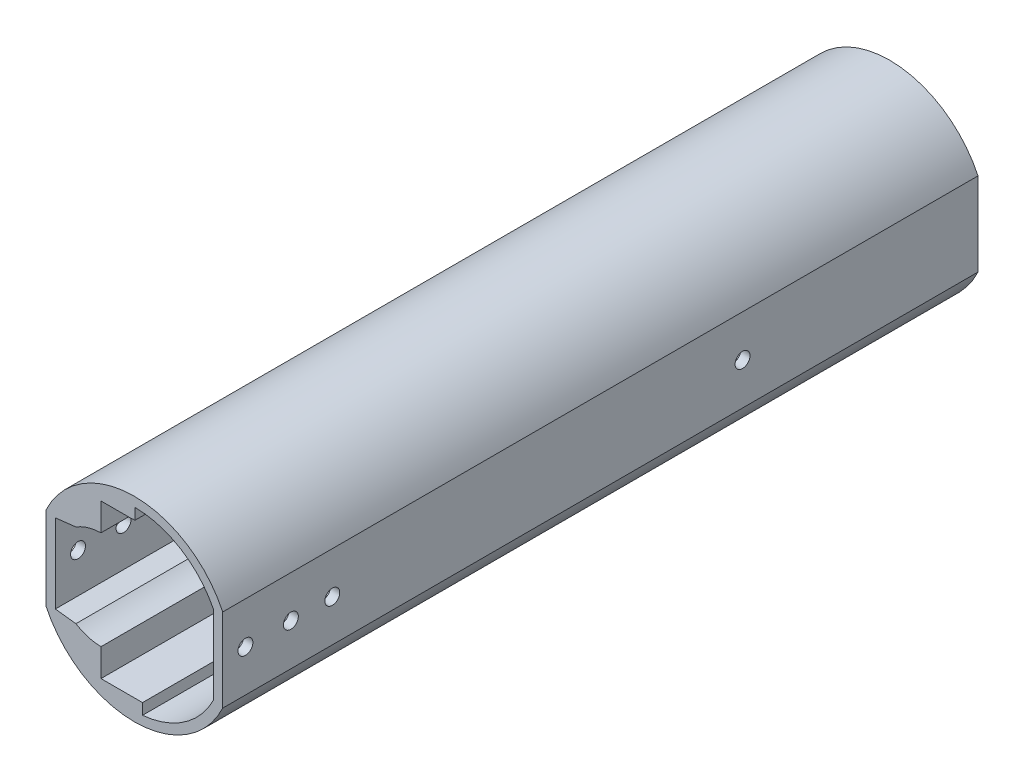
ISO-10303-21;
HEADER;
FILE_DESCRIPTION(('STEP AP214'),'2;1');
FILE_NAME('part.step','',(''),(''),'','','');
FILE_SCHEMA(('AUTOMOTIVE_DESIGN { 1 0 10303 214 1 1 1 1 }'));
ENDSEC;
DATA;
#1=APPLICATION_CONTEXT('core data for automotive mechanical design processes');
#2=APPLICATION_PROTOCOL_DEFINITION('international standard','automotive_design',2000,#1);
#3=PRODUCT_CONTEXT('',#1,'mechanical');
#4=PRODUCT('Part','Part','',(#3));
#5=PRODUCT_RELATED_PRODUCT_CATEGORY('part','',(#4));
#6=PRODUCT_DEFINITION_FORMATION('','',#4);
#7=PRODUCT_DEFINITION_CONTEXT('part definition',#1,'design');
#8=PRODUCT_DEFINITION('design','',#6,#7);
#9=PRODUCT_DEFINITION_SHAPE('','',#8);
#10=(LENGTH_UNIT() NAMED_UNIT(*) SI_UNIT(.MILLI.,.METRE.));
#11=(NAMED_UNIT(*) PLANE_ANGLE_UNIT() SI_UNIT($,.RADIAN.));
#12=(NAMED_UNIT(*) SI_UNIT($,.STERADIAN.) SOLID_ANGLE_UNIT());
#13=UNCERTAINTY_MEASURE_WITH_UNIT(LENGTH_MEASURE(1.E-05),#10,'distance_accuracy_value','');
#14=(GEOMETRIC_REPRESENTATION_CONTEXT(3) GLOBAL_UNCERTAINTY_ASSIGNED_CONTEXT((#13)) GLOBAL_UNIT_ASSIGNED_CONTEXT((#10,
#11,#12)) REPRESENTATION_CONTEXT('',''));
#15=CARTESIAN_POINT('',(0.,0.,0.));
#16=DIRECTION('',(0.,0.,1.));
#17=DIRECTION('',(1.,0.,0.));
#18=AXIS2_PLACEMENT_3D('',#15,#16,#17);
#19=CARTESIAN_POINT('',(-1.74996172605003,-0.0491266672354965,-140.));
#20=DIRECTION('',(0.,0.,-1.));
#21=DIRECTION('',(-1.,0.,0.));
#22=AXIS2_PLACEMENT_3D('',#19,#20,#21);
#23=PLANE('',#22);
#24=CARTESIAN_POINT('',(-1.59999999999996,-8.70722550504569,-140.));
#25=DIRECTION('',(0.,0.,-1.));
#26=DIRECTION('',(-1.,0.,0.));
#27=AXIS2_PLACEMENT_3D('',#24,#25,#26);
#28=CIRCLE('',#27,6.2);
#29=CARTESIAN_POINT('',(-7.79999999999996,-8.70722550504569,-140.));
#30=VERTEX_POINT('',#29);
#31=EDGE_CURVE('E181',#30,#30,#28,.F.);
#32=ORIENTED_EDGE('',*,*,#31,.F.);
#33=EDGE_LOOP('',(#32));
#34=FACE_BOUND('',#33,.T.);
#35=DIRECTION('',(0.,1.,0.));
#36=VECTOR('',#35,1.);
#37=CARTESIAN_POINT('',(-1.6,16.45,-140.));
#38=LINE('',#37,#36);
#39=CARTESIAN_POINT('',(-1.6,16.5251,-140.));
#40=VERTEX_POINT('',#39);
#41=CARTESIAN_POINT('',(-1.6,18.9002416837012,-140.));
#42=VERTEX_POINT('',#41);
#43=EDGE_CURVE('E329',#40,#42,#38,.T.);
#44=ORIENTED_EDGE('',*,*,#43,.F.);
#45=CARTESIAN_POINT('',(-1.59999999999996,10.3251,-140.));
#46=DIRECTION('',(0.,0.,-1.));
#47=DIRECTION('',(-1.,0.,0.));
#48=AXIS2_PLACEMENT_3D('',#45,#46,#47);
#49=CIRCLE('',#48,6.2);
#50=CARTESIAN_POINT('',(-2.56208107246732,16.45,-140.));
#51=VERTEX_POINT('',#50);
#52=EDGE_CURVE('E285',#40,#51,#49,.T.);
#53=ORIENTED_EDGE('',*,*,#52,.T.);
#54=DIRECTION('',(1.,0.,0.));
#55=VECTOR('',#54,1.);
#56=CARTESIAN_POINT('',(-8.91199999971296,16.45,-140.));
#57=LINE('',#56,#55);
#58=CARTESIAN_POINT('',(-8.91199999971296,16.45,-140.));
#59=VERTEX_POINT('',#58);
#60=EDGE_CURVE('E190',#59,#51,#57,.T.);
#61=ORIENTED_EDGE('',*,*,#60,.F.);
#62=DIRECTION('',(0.,1.,0.));
#63=VECTOR('',#62,1.);
#64=CARTESIAN_POINT('',(-8.91199999971296,10.5231996089647,-140.));
#65=LINE('',#64,#63);
#66=CARTESIAN_POINT('',(-8.91199999971296,10.5231996089647,-140.));
#67=VERTEX_POINT('',#66);
#68=EDGE_CURVE('E325',#67,#59,#65,.T.);
#69=ORIENTED_EDGE('',*,*,#68,.F.);
#70=CARTESIAN_POINT('',(-8.71200000000002,0.,-140.));
#71=DIRECTION('',(0.,0.,-1.));
#72=DIRECTION('',(-1.,0.,0.));
#73=AXIS2_PLACEMENT_3D('',#70,#71,#72);
#74=CIRCLE('',#73,10.5251);
#75=CARTESIAN_POINT('',(-14.2787810578106,8.9324508766856,-140.));
#76=VERTEX_POINT('',#75);
#77=EDGE_CURVE('E322',#76,#67,#74,.T.);
#78=ORIENTED_EDGE('',*,*,#77,.F.);
#79=DIRECTION('',(0.993460859770838,0.1141732022122,0.));
#80=VECTOR('',#79,1.);
#81=CARTESIAN_POINT('',(-18.6999234521001,8.42435236467318,-140.));
#82=LINE('',#81,#80);
#83=CARTESIAN_POINT('',(-18.6999234521001,8.42435236467318,-140.));
#84=VERTEX_POINT('',#83);
#85=EDGE_CURVE('E319',#84,#76,#82,.T.);
#86=ORIENTED_EDGE('',*,*,#85,.F.);
#87=DIRECTION('',(0.,1.,0.));
#88=VECTOR('',#87,1.);
#89=CARTESIAN_POINT('',(-18.6999234520998,-8.52260569914465,-140.));
#90=LINE('',#89,#88);
#91=CARTESIAN_POINT('',(-18.6999234520998,-8.52260569914465,-140.));
#92=VERTEX_POINT('',#91);
#93=EDGE_CURVE('E316',#92,#84,#90,.T.);
#94=ORIENTED_EDGE('',*,*,#93,.F.);
#95=DIRECTION('',(-0.993460859770849,0.114173202212101,0.));
#96=VECTOR('',#95,1.);
#97=CARTESIAN_POINT('',(-14.2787810578106,-9.03070421115659,-140.));
#98=LINE('',#97,#96);
#99=CARTESIAN_POINT('',(-14.2787810578106,-9.03070421115659,-140.));
#100=VERTEX_POINT('',#99);
#101=EDGE_CURVE('E314',#100,#92,#98,.T.);
#102=ORIENTED_EDGE('',*,*,#101,.F.);
#103=CARTESIAN_POINT('',(-8.71200000000002,-0.0982533344709912,-140.));
#104=DIRECTION('',(0.,0.,-1.));
#105=DIRECTION('',(-1.,0.,0.));
#106=AXIS2_PLACEMENT_3D('',#103,#104,#105);
#107=CIRCLE('',#106,10.5251);
#108=CARTESIAN_POINT('',(-8.91199999971296,-10.6214529434357,-140.));
#109=VERTEX_POINT('',#108);
#110=EDGE_CURVE('E311',#109,#100,#107,.T.);
#111=ORIENTED_EDGE('',*,*,#110,.F.);
#112=DIRECTION('',(0.,1.,0.));
#113=VECTOR('',#112,1.);
#114=CARTESIAN_POINT('',(-8.91199999971296,-16.548253334471,-140.));
#115=LINE('',#114,#113);
#116=CARTESIAN_POINT('',(-8.91199999971296,-16.548253334471,-140.));
#117=VERTEX_POINT('',#116);
#118=EDGE_CURVE('E308',#117,#109,#115,.T.);
#119=ORIENTED_EDGE('',*,*,#118,.F.);
#120=DIRECTION('',(-1.,0.,0.));
#121=VECTOR('',#120,1.);
#122=CARTESIAN_POINT('',(0.,-16.548253334471,-140.));
#123=LINE('',#122,#121);
#124=CARTESIAN_POINT('',(0.,-16.548253334471,-140.));
#125=VERTEX_POINT('',#124);
#126=EDGE_CURVE('E305',#125,#117,#123,.T.);
#127=ORIENTED_EDGE('',*,*,#126,.F.);
#128=DIRECTION('',(0.,1.,0.));
#129=VECTOR('',#128,1.);
#130=CARTESIAN_POINT('',(0.,-18.91811401092,-140.));
#131=LINE('',#130,#129);
#132=CARTESIAN_POINT('',(0.,-18.91811401092,-140.));
#133=VERTEX_POINT('',#132);
#134=EDGE_CURVE('E302',#133,#125,#131,.T.);
#135=ORIENTED_EDGE('',*,*,#134,.F.);
#136=CARTESIAN_POINT('',(-1.74996172605003,-0.0491266672354965,-140.));
#137=DIRECTION('',(0.,0.,-1.));
#138=DIRECTION('',(-1.,0.,0.));
#139=AXIS2_PLACEMENT_3D('',#136,#137,#138);
#140=CIRCLE('',#139,18.9499617260504);
#141=CARTESIAN_POINT('',(15.2000000000004,-8.52260569914462,-140.));
#142=VERTEX_POINT('',#141);
#143=EDGE_CURVE('E299',#142,#133,#140,.T.);
#144=ORIENTED_EDGE('',*,*,#143,.F.);
#145=DIRECTION('',(0.,-1.,0.));
#146=VECTOR('',#145,1.);
#147=CARTESIAN_POINT('',(15.1999999999999,8.42435236467339,-140.));
#148=LINE('',#147,#146);
#149=CARTESIAN_POINT('',(15.1999999999999,8.42435236467339,-140.));
#150=VERTEX_POINT('',#149);
#151=EDGE_CURVE('E334',#150,#142,#148,.T.);
#152=ORIENTED_EDGE('',*,*,#151,.F.);
#153=CARTESIAN_POINT('',(-1.74996172605003,-0.0491266672354965,-140.));
#154=DIRECTION('',(0.,0.,-1.));
#155=DIRECTION('',(-1.,0.,0.));
#156=AXIS2_PLACEMENT_3D('',#153,#154,#155);
#157=CIRCLE('',#156,18.94996172605);
#158=EDGE_CURVE('E331',#42,#150,#157,.T.);
#159=ORIENTED_EDGE('',*,*,#158,.F.);
#160=EDGE_LOOP('',(#44,#53,#61,#69,#78,#86,#94,#102,#111,#119,#127,#135,#144,#152,#159));
#161=FACE_BOUND('',#160,.T.);
#162=ADVANCED_FACE('F41',(#34,#161),#23,.F.);
#163=CARTESIAN_POINT('',(-1.74996172605003,-0.0491266672354965,-142.));
#164=DIRECTION('',(0.,0.,-1.));
#165=DIRECTION('',(-1.,0.,0.));
#166=AXIS2_PLACEMENT_3D('',#163,#164,#165);
#167=PLANE('',#166);
#168=CARTESIAN_POINT('',(-1.59999999999996,-8.70722550504569,-142.));
#169=DIRECTION('',(0.,0.,-1.));
#170=DIRECTION('',(-1.,0.,0.));
#171=AXIS2_PLACEMENT_3D('',#168,#169,#170);
#172=CIRCLE('',#171,6.2);
#173=CARTESIAN_POINT('',(-7.79999999999996,-8.70722550504569,-142.));
#174=VERTEX_POINT('',#173);
#175=EDGE_CURVE('E277',#174,#174,#172,.F.);
#176=ORIENTED_EDGE('',*,*,#175,.T.);
#177=EDGE_LOOP('',(#176));
#178=FACE_BOUND('',#177,.T.);
#179=CARTESIAN_POINT('',(-1.74996172605003,-0.0491266672354965,-142.));
#180=DIRECTION('',(0.,0.,-1.));
#181=DIRECTION('',(-1.,0.,0.));
#182=AXIS2_PLACEMENT_3D('',#179,#180,#181);
#183=CIRCLE('',#182,20.9499617260503);
#184=CARTESIAN_POINT('',(17.2000000000003,-8.9822026718491,-142.));
#185=VERTEX_POINT('',#184);
#186=CARTESIAN_POINT('',(-20.6999234521002,-8.98220267184937,-142.));
#187=VERTEX_POINT('',#186);
#188=EDGE_CURVE('E191',#185,#187,#183,.T.);
#189=ORIENTED_EDGE('',*,*,#188,.T.);
#190=DIRECTION('',(0.,1.,0.));
#191=VECTOR('',#190,1.);
#192=CARTESIAN_POINT('',(-20.6999234521002,-8.98220267184937,-142.));
#193=LINE('',#192,#191);
#194=CARTESIAN_POINT('',(-20.6999234521002,8.88394933737773,-142.));
#195=VERTEX_POINT('',#194);
#196=EDGE_CURVE('E290',#187,#195,#193,.T.);
#197=ORIENTED_EDGE('',*,*,#196,.T.);
#198=CARTESIAN_POINT('',(-1.74996172605003,-0.0491266672354965,-142.));
#199=DIRECTION('',(0.,0.,-1.));
#200=DIRECTION('',(-1.,0.,0.));
#201=AXIS2_PLACEMENT_3D('',#198,#199,#200);
#202=CIRCLE('',#201,20.9499617260501);
#203=CARTESIAN_POINT('',(17.2000000000003,8.88394933737758,-142.));
#204=VERTEX_POINT('',#203);
#205=EDGE_CURVE('E293',#195,#204,#202,.T.);
#206=ORIENTED_EDGE('',*,*,#205,.T.);
#207=DIRECTION('',(0.,-1.,0.));
#208=VECTOR('',#207,1.);
#209=CARTESIAN_POINT('',(17.2000000000003,8.88394933737758,-142.));
#210=LINE('',#209,#208);
#211=EDGE_CURVE('E296',#204,#185,#210,.T.);
#212=ORIENTED_EDGE('',*,*,#211,.T.);
#213=EDGE_LOOP('',(#189,#197,#206,#212));
#214=FACE_BOUND('',#213,.T.);
#215=CARTESIAN_POINT('',(-1.59999999999996,10.3251,-142.));
#216=DIRECTION('',(0.,0.,-1.));
#217=DIRECTION('',(-1.,0.,0.));
#218=AXIS2_PLACEMENT_3D('',#215,#216,#217);
#219=CIRCLE('',#218,6.2);
#220=CARTESIAN_POINT('',(-7.79999999999996,10.3251,-142.));
#221=VERTEX_POINT('',#220);
#222=EDGE_CURVE('E182',#221,#221,#219,.T.);
#223=ORIENTED_EDGE('',*,*,#222,.F.);
#224=EDGE_LOOP('',(#223));
#225=FACE_BOUND('',#224,.T.);
#226=ADVANCED_FACE('F415',(#178,#214,#225),#167,.T.);
#227=CARTESIAN_POINT('',(0.,16.45,-95.));
#228=DIRECTION('',(0.,1.,0.));
#229=DIRECTION('',(0.,0.,1.));
#230=AXIS2_PLACEMENT_3D('',#227,#228,#229);
#231=PLANE('',#230);
#232=ORIENTED_EDGE('',*,*,#60,.T.);
#233=DIRECTION('',(0.,0.,-1.));
#234=VECTOR('',#233,1.);
#235=CARTESIAN_POINT('',(-2.56208107246732,16.45,20.));
#236=LINE('',#235,#234);
#237=CARTESIAN_POINT('',(-2.56208107246732,16.45,20.));
#238=VERTEX_POINT('',#237);
#239=EDGE_CURVE('E58',#51,#238,#236,.F.);
#240=ORIENTED_EDGE('',*,*,#239,.T.);
#241=DIRECTION('',(-1.,0.,0.));
#242=VECTOR('',#241,1.);
#243=CARTESIAN_POINT('',(-1.6,16.45,20.));
#244=LINE('',#243,#242);
#245=CARTESIAN_POINT('',(-8.91199999971296,16.45,20.));
#246=VERTEX_POINT('',#245);
#247=EDGE_CURVE('E188',#238,#246,#244,.T.);
#248=ORIENTED_EDGE('',*,*,#247,.T.);
#249=DIRECTION('',(0.,0.,1.));
#250=VECTOR('',#249,1.);
#251=CARTESIAN_POINT('',(-8.91199999971296,16.45,-95.));
#252=LINE('',#251,#250);
#253=EDGE_CURVE('E244',#59,#246,#252,.T.);
#254=ORIENTED_EDGE('',*,*,#253,.F.);
#255=EDGE_LOOP('',(#232,#240,#248,#254));
#256=FACE_BOUND('',#255,.T.);
#257=ADVANCED_FACE('F186',(#256),#231,.F.);
#258=CARTESIAN_POINT('',(-1.74996172605003,-0.0491266672354965,-151.497856445771));
#259=DIRECTION('',(0.,0.,1.));
#260=DIRECTION('',(1.,0.,0.));
#261=AXIS2_PLACEMENT_3D('',#258,#259,#260);
#262=CYLINDRICAL_SURFACE('',#261,18.9499617260502);
#263=DIRECTION('',(0.,0.,1.));
#264=VECTOR('',#263,1.);
#265=CARTESIAN_POINT('',(15.2000000000004,-8.52260569914462,-151.497856445771));
#266=LINE('',#265,#264);
#267=CARTESIAN_POINT('',(15.2000000000004,-8.52260569914462,20.));
#268=VERTEX_POINT('',#267);
#269=EDGE_CURVE('E252',#142,#268,#266,.T.);
#270=ORIENTED_EDGE('',*,*,#269,.F.);
#271=ORIENTED_EDGE('',*,*,#143,.T.);
#272=DIRECTION('',(0.,0.,1.));
#273=VECTOR('',#272,1.);
#274=CARTESIAN_POINT('',(0.,-18.91811401092,-95.));
#275=LINE('',#274,#273);
#276=CARTESIAN_POINT('',(0.,-18.9181140109203,20.));
#277=VERTEX_POINT('',#276);
#278=EDGE_CURVE('E232',#133,#277,#275,.T.);
#279=ORIENTED_EDGE('',*,*,#278,.T.);
#280=CARTESIAN_POINT('',(-1.74996172605003,-0.0491266672354965,20.));
#281=DIRECTION('',(0.,0.,1.));
#282=DIRECTION('',(1.,0.,0.));
#283=AXIS2_PLACEMENT_3D('',#280,#281,#282);
#284=CIRCLE('',#283,18.9499617260504);
#285=EDGE_CURVE('E349',#277,#268,#284,.T.);
#286=ORIENTED_EDGE('',*,*,#285,.T.);
#287=EDGE_LOOP('',(#270,#271,#279,#286));
#288=FACE_BOUND('',#287,.T.);
#289=ADVANCED_FACE('F373',(#288),#262,.F.);
#290=CARTESIAN_POINT('',(-1.74996172605003,-0.0491266672354965,-151.497856445771));
#291=DIRECTION('',(0.,0.,1.));
#292=DIRECTION('',(1.,0.,0.));
#293=AXIS2_PLACEMENT_3D('',#290,#291,#292);
#294=CYLINDRICAL_SURFACE('',#293,18.94996172605);
#295=DIRECTION('',(0.,0.,1.));
#296=VECTOR('',#295,1.);
#297=CARTESIAN_POINT('',(15.2,8.42435236467342,-151.497856445771));
#298=LINE('',#297,#296);
#299=CARTESIAN_POINT('',(15.2,8.42435236467344,20.));
#300=VERTEX_POINT('',#299);
#301=EDGE_CURVE('E254',#150,#300,#298,.T.);
#302=ORIENTED_EDGE('',*,*,#301,.T.);
#303=CARTESIAN_POINT('',(-1.74996172605003,-0.0491266672354965,20.));
#304=DIRECTION('',(0.,0.,1.));
#305=DIRECTION('',(1.,0.,0.));
#306=AXIS2_PLACEMENT_3D('',#303,#304,#305);
#307=CIRCLE('',#306,18.9499617260501);
#308=CARTESIAN_POINT('',(-1.6,18.9002416837013,20.));
#309=VERTEX_POINT('',#308);
#310=EDGE_CURVE('E203',#300,#309,#307,.T.);
#311=ORIENTED_EDGE('',*,*,#310,.T.);
#312=DIRECTION('',(0.,0.,1.));
#313=VECTOR('',#312,1.);
#314=CARTESIAN_POINT('',(-1.6,18.9002416837013,-95.));
#315=LINE('',#314,#313);
#316=EDGE_CURVE('E228',#42,#309,#315,.T.);
#317=ORIENTED_EDGE('',*,*,#316,.F.);
#318=ORIENTED_EDGE('',*,*,#158,.T.);
#319=EDGE_LOOP('',(#302,#311,#317,#318));
#320=FACE_BOUND('',#319,.T.);
#321=ADVANCED_FACE('F358',(#320),#294,.F.);
#322=CARTESIAN_POINT('',(-20.6999234520999,-2.89421281809422E-13,-151.497856445771));
#323=DIRECTION('',(-1.,0.,0.));
#324=DIRECTION('',(0.,-1.,0.));
#325=AXIS2_PLACEMENT_3D('',#322,#323,#324);
#326=PLANE('',#325);
#327=CARTESIAN_POINT('',(-20.6999234521002,-0.024563333617532,15.125));
#328=DIRECTION('',(1.,0.,0.));
#329=DIRECTION('',(0.,0.,-1.));
#330=AXIS2_PLACEMENT_3D('',#327,#328,#329);
#331=CIRCLE('',#330,1.6);
#332=CARTESIAN_POINT('',(-20.6999234521002,-0.024563333617532,13.525));
#333=VERTEX_POINT('',#332);
#334=EDGE_CURVE('E271',#333,#333,#331,.T.);
#335=ORIENTED_EDGE('',*,*,#334,.T.);
#336=EDGE_LOOP('',(#335));
#337=FACE_BOUND('',#336,.T.);
#338=CARTESIAN_POINT('',(-20.6999234521002,-0.0491266672352679,5.375));
#339=DIRECTION('',(1.,0.,0.));
#340=DIRECTION('',(0.,0.,-1.));
#341=AXIS2_PLACEMENT_3D('',#338,#339,#340);
#342=CIRCLE('',#341,1.6);
#343=CARTESIAN_POINT('',(-20.6999234521002,-0.0491266672352679,3.775));
#344=VERTEX_POINT('',#343);
#345=EDGE_CURVE('E910',#344,#344,#342,.T.);
#346=ORIENTED_EDGE('',*,*,#345,.T.);
#347=EDGE_LOOP('',(#346));
#348=FACE_BOUND('',#347,.T.);
#349=DIRECTION('',(0.,0.,1.));
#350=VECTOR('',#349,1.);
#351=CARTESIAN_POINT('',(-20.6999234521001,8.88394933737765,-151.497856445771));
#352=LINE('',#351,#350);
#353=CARTESIAN_POINT('',(-20.6999234521001,8.88394933737765,20.));
#354=VERTEX_POINT('',#353);
#355=EDGE_CURVE('E247',#195,#354,#352,.T.);
#356=ORIENTED_EDGE('',*,*,#355,.F.);
#357=ORIENTED_EDGE('',*,*,#196,.F.);
#358=DIRECTION('',(0.,0.,1.));
#359=VECTOR('',#358,1.);
#360=CARTESIAN_POINT('',(-20.6999234520998,-8.98220267184917,-151.497856445771));
#361=LINE('',#360,#359);
#362=CARTESIAN_POINT('',(-20.6999234520998,-8.98220267184917,20.));
#363=VERTEX_POINT('',#362);
#364=EDGE_CURVE('E243',#187,#363,#361,.T.);
#365=ORIENTED_EDGE('',*,*,#364,.T.);
#366=DIRECTION('',(0.,-1.,0.));
#367=VECTOR('',#366,1.);
#368=CARTESIAN_POINT('',(-20.6999234521001,8.88394933737765,20.));
#369=LINE('',#368,#367);
#370=EDGE_CURVE('E219',#354,#363,#369,.T.);
#371=ORIENTED_EDGE('',*,*,#370,.F.);
#372=EDGE_LOOP('',(#356,#357,#365,#371));
#373=FACE_BOUND('',#372,.T.);
#374=ADVANCED_FACE('F43',(#337,#348,#373),#326,.T.);
#375=CARTESIAN_POINT('',(-1.74996172605003,-0.0491266672354965,-151.497856445771));
#376=DIRECTION('',(0.,0.,1.));
#377=DIRECTION('',(1.,0.,0.));
#378=AXIS2_PLACEMENT_3D('',#375,#376,#377);
#379=CYLINDRICAL_SURFACE('',#378,20.9499617260501);
#380=DIRECTION('',(0.,0.,1.));
#381=VECTOR('',#380,1.);
#382=CARTESIAN_POINT('',(17.2000000000004,8.88394933737765,-151.497856445771));
#383=LINE('',#382,#381);
#384=CARTESIAN_POINT('',(17.2000000000004,8.88394933737765,20.));
#385=VERTEX_POINT('',#384);
#386=EDGE_CURVE('E249',#204,#385,#383,.T.);
#387=ORIENTED_EDGE('',*,*,#386,.F.);
#388=ORIENTED_EDGE('',*,*,#205,.F.);
#389=ORIENTED_EDGE('',*,*,#355,.T.);
#390=CARTESIAN_POINT('',(-1.74996172605003,-0.0491266672354965,20.));
#391=DIRECTION('',(0.,0.,1.));
#392=DIRECTION('',(1.,0.,0.));
#393=AXIS2_PLACEMENT_3D('',#390,#391,#392);
#394=CIRCLE('',#393,20.9499617260501);
#395=EDGE_CURVE('E216',#385,#354,#394,.T.);
#396=ORIENTED_EDGE('',*,*,#395,.F.);
#397=EDGE_LOOP('',(#387,#388,#389,#396));
#398=FACE_BOUND('',#397,.T.);
#399=ADVANCED_FACE('F455',(#398),#379,.T.);
#400=CARTESIAN_POINT('',(17.2000000000004,0.,-151.497856445771));
#401=DIRECTION('',(-1.,0.,0.));
#402=DIRECTION('',(0.,0.,1.));
#403=AXIS2_PLACEMENT_3D('',#400,#401,#402);
#404=PLANE('',#403);
#405=CARTESIAN_POINT('',(17.2000000000004,-0.024563333617532,15.125));
#406=DIRECTION('',(1.,0.,0.));
#407=DIRECTION('',(0.,0.,-1.));
#408=AXIS2_PLACEMENT_3D('',#405,#406,#407);
#409=CIRCLE('',#408,1.6);
#410=CARTESIAN_POINT('',(17.2000000000004,-0.024563333617532,13.525));
#411=VERTEX_POINT('',#410);
#412=EDGE_CURVE('E913',#411,#411,#409,.T.);
#413=ORIENTED_EDGE('',*,*,#412,.F.);
#414=EDGE_LOOP('',(#413));
#415=FACE_BOUND('',#414,.T.);
#416=CARTESIAN_POINT('',(17.2000000000004,-0.0491266672352679,5.375));
#417=DIRECTION('',(1.,0.,0.));
#418=DIRECTION('',(0.,0.,-1.));
#419=AXIS2_PLACEMENT_3D('',#416,#417,#418);
#420=CIRCLE('',#419,1.6);
#421=CARTESIAN_POINT('',(17.2000000000004,-0.0491266672352679,3.775));
#422=VERTEX_POINT('',#421);
#423=EDGE_CURVE('E905',#422,#422,#420,.T.);
#424=ORIENTED_EDGE('',*,*,#423,.F.);
#425=EDGE_LOOP('',(#424));
#426=FACE_BOUND('',#425,.T.);
#427=CARTESIAN_POINT('',(17.2000000000004,-0.049126667235695,-3.5));
#428=DIRECTION('',(1.,0.,0.));
#429=DIRECTION('',(0.,0.,-1.));
#430=AXIS2_PLACEMENT_3D('',#427,#428,#429);
#431=CIRCLE('',#430,1.6);
#432=CARTESIAN_POINT('',(17.2000000000004,-0.049126667235695,-5.1));
#433=VERTEX_POINT('',#432);
#434=EDGE_CURVE('E903',#433,#433,#431,.T.);
#435=ORIENTED_EDGE('',*,*,#434,.F.);
#436=EDGE_LOOP('',(#435));
#437=FACE_BOUND('',#436,.T.);
#438=CARTESIAN_POINT('',(17.2000000000004,-0.0491266672356838,-91.5));
#439=DIRECTION('',(1.,0.,0.));
#440=DIRECTION('',(0.,0.,-1.));
#441=AXIS2_PLACEMENT_3D('',#438,#439,#440);
#442=CIRCLE('',#441,1.60000000000001);
#443=CARTESIAN_POINT('',(17.2000000000004,-0.0491266672356838,-93.1));
#444=VERTEX_POINT('',#443);
#445=EDGE_CURVE('E901',#444,#444,#442,.T.);
#446=ORIENTED_EDGE('',*,*,#445,.F.);
#447=EDGE_LOOP('',(#446));
#448=FACE_BOUND('',#447,.T.);
#449=DIRECTION('',(0.,0.,1.));
#450=VECTOR('',#449,1.);
#451=CARTESIAN_POINT('',(17.2000000000004,-8.98220267184917,-151.497856445771));
#452=LINE('',#451,#450);
#453=CARTESIAN_POINT('',(17.2,-8.98220267184899,20.));
#454=VERTEX_POINT('',#453);
#455=EDGE_CURVE('E11',#185,#454,#452,.T.);
#456=ORIENTED_EDGE('',*,*,#455,.F.);
#457=ORIENTED_EDGE('',*,*,#211,.F.);
#458=ORIENTED_EDGE('',*,*,#386,.T.);
#459=DIRECTION('',(0.,1.,0.));
#460=VECTOR('',#459,1.);
#461=CARTESIAN_POINT('',(17.2000000000001,-8.98220267184905,20.));
#462=LINE('',#461,#460);
#463=EDGE_CURVE('E225',#454,#385,#462,.T.);
#464=ORIENTED_EDGE('',*,*,#463,.F.);
#465=EDGE_LOOP('',(#456,#457,#458,#464));
#466=FACE_BOUND('',#465,.T.);
#467=ADVANCED_FACE('F453',(#415,#426,#437,#448,#466),#404,.F.);
#468=CARTESIAN_POINT('',(15.2000000000002,3.7652815390254E-13,-151.497856445771));
#469=DIRECTION('',(-1.,0.,0.));
#470=DIRECTION('',(0.,-1.,0.));
#471=AXIS2_PLACEMENT_3D('',#468,#469,#470);
#472=PLANE('',#471);
#473=CARTESIAN_POINT('',(15.2000000000002,-0.024563333617532,15.125));
#474=DIRECTION('',(-1.,0.,0.));
#475=DIRECTION('',(0.,-1.,0.));
#476=AXIS2_PLACEMENT_3D('',#473,#474,#475);
#477=CIRCLE('',#476,1.6);
#478=CARTESIAN_POINT('',(15.2000000000002,-1.62456333361753,15.125));
#479=VERTEX_POINT('',#478);
#480=EDGE_CURVE('E275',#479,#479,#477,.T.);
#481=ORIENTED_EDGE('',*,*,#480,.F.);
#482=EDGE_LOOP('',(#481));
#483=FACE_BOUND('',#482,.T.);
#484=CARTESIAN_POINT('',(15.2000000000002,-0.0491266672352679,5.375));
#485=DIRECTION('',(-1.,0.,0.));
#486=DIRECTION('',(0.,-1.,0.));
#487=AXIS2_PLACEMENT_3D('',#484,#485,#486);
#488=CIRCLE('',#487,1.6);
#489=CARTESIAN_POINT('',(15.2000000000002,-1.64912666723527,5.375));
#490=VERTEX_POINT('',#489);
#491=EDGE_CURVE('E259',#490,#490,#488,.T.);
#492=ORIENTED_EDGE('',*,*,#491,.F.);
#493=EDGE_LOOP('',(#492));
#494=FACE_BOUND('',#493,.T.);
#495=CARTESIAN_POINT('',(15.2000000000002,-0.049126667235695,-3.5));
#496=DIRECTION('',(-1.,0.,0.));
#497=DIRECTION('',(0.,-1.,0.));
#498=AXIS2_PLACEMENT_3D('',#495,#496,#497);
#499=CIRCLE('',#498,1.6);
#500=CARTESIAN_POINT('',(15.2000000000002,-1.6491266672357,-3.5));
#501=VERTEX_POINT('',#500);
#502=EDGE_CURVE('E260',#501,#501,#499,.T.);
#503=ORIENTED_EDGE('',*,*,#502,.F.);
#504=EDGE_LOOP('',(#503));
#505=FACE_BOUND('',#504,.T.);
#506=CARTESIAN_POINT('',(15.2000000000002,-0.0491266672356838,-91.5));
#507=DIRECTION('',(-1.,0.,0.));
#508=DIRECTION('',(0.,-1.,0.));
#509=AXIS2_PLACEMENT_3D('',#506,#507,#508);
#510=CIRCLE('',#509,1.60000000000001);
#511=CARTESIAN_POINT('',(15.2000000000002,-1.64912666723569,-91.5));
#512=VERTEX_POINT('',#511);
#513=EDGE_CURVE('E266',#512,#512,#510,.T.);
#514=ORIENTED_EDGE('',*,*,#513,.F.);
#515=EDGE_LOOP('',(#514));
#516=FACE_BOUND('',#515,.T.);
#517=ORIENTED_EDGE('',*,*,#301,.F.);
#518=ORIENTED_EDGE('',*,*,#151,.T.);
#519=ORIENTED_EDGE('',*,*,#269,.T.);
#520=DIRECTION('',(0.,1.,0.));
#521=VECTOR('',#520,1.);
#522=CARTESIAN_POINT('',(15.2000000000004,-8.52260569914462,20.));
#523=LINE('',#522,#521);
#524=EDGE_CURVE('E352',#268,#300,#523,.T.);
#525=ORIENTED_EDGE('',*,*,#524,.T.);
#526=EDGE_LOOP('',(#517,#518,#519,#525));
#527=FACE_BOUND('',#526,.T.);
#528=ADVANCED_FACE('F368',(#483,#494,#505,#516,#527),#472,.T.);
#529=CARTESIAN_POINT('',(-18.6999234520999,-2.60325815885485E-13,-151.497856445771));
#530=DIRECTION('',(-1.,0.,0.));
#531=DIRECTION('',(0.,-1.,0.));
#532=AXIS2_PLACEMENT_3D('',#529,#530,#531);
#533=PLANE('',#532);
#534=CARTESIAN_POINT('',(-18.6999234520999,-0.024563333617532,15.125));
#535=DIRECTION('',(-1.,0.,0.));
#536=DIRECTION('',(0.,-1.,0.));
#537=AXIS2_PLACEMENT_3D('',#534,#535,#536);
#538=CIRCLE('',#537,1.6);
#539=CARTESIAN_POINT('',(-18.6999234520999,-1.62456333361753,15.125));
#540=VERTEX_POINT('',#539);
#541=EDGE_CURVE('E45',#540,#540,#538,.T.);
#542=ORIENTED_EDGE('',*,*,#541,.T.);
#543=EDGE_LOOP('',(#542));
#544=FACE_BOUND('',#543,.T.);
#545=CARTESIAN_POINT('',(-18.6999234520999,-0.0491266672352679,5.375));
#546=DIRECTION('',(-1.,0.,0.));
#547=DIRECTION('',(0.,-1.,0.));
#548=AXIS2_PLACEMENT_3D('',#545,#546,#547);
#549=CIRCLE('',#548,1.6);
#550=CARTESIAN_POINT('',(-18.6999234520999,-1.64912666723527,5.375));
#551=VERTEX_POINT('',#550);
#552=EDGE_CURVE('E257',#551,#551,#549,.T.);
#553=ORIENTED_EDGE('',*,*,#552,.T.);
#554=EDGE_LOOP('',(#553));
#555=FACE_BOUND('',#554,.T.);
#556=DIRECTION('',(0.,0.,1.));
#557=VECTOR('',#556,1.);
#558=CARTESIAN_POINT('',(-18.6999234520998,-8.52260569914465,-151.497856445771));
#559=LINE('',#558,#557);
#560=CARTESIAN_POINT('',(-18.6999234520998,-8.52260569914465,20.));
#561=VERTEX_POINT('',#560);
#562=EDGE_CURVE('E66',#92,#561,#559,.T.);
#563=ORIENTED_EDGE('',*,*,#562,.F.);
#564=ORIENTED_EDGE('',*,*,#93,.T.);
#565=DIRECTION('',(0.,0.,1.));
#566=VECTOR('',#565,1.);
#567=CARTESIAN_POINT('',(-18.6999234521001,8.42435236467318,-151.497856445771));
#568=LINE('',#567,#566);
#569=CARTESIAN_POINT('',(-18.6999234521001,8.42435236467318,20.));
#570=VERTEX_POINT('',#569);
#571=EDGE_CURVE('E50',#84,#570,#568,.T.);
#572=ORIENTED_EDGE('',*,*,#571,.T.);
#573=DIRECTION('',(0.,-1.,0.));
#574=VECTOR('',#573,1.);
#575=CARTESIAN_POINT('',(-18.6999234521001,8.42435236467318,20.));
#576=LINE('',#575,#574);
#577=EDGE_CURVE('E212',#570,#561,#576,.T.);
#578=ORIENTED_EDGE('',*,*,#577,.T.);
#579=EDGE_LOOP('',(#563,#564,#572,#578));
#580=FACE_BOUND('',#579,.T.);
#581=ADVANCED_FACE('F394',(#544,#555,#580),#533,.F.);
#582=CARTESIAN_POINT('',(-1.74996172605003,-0.0491266672354965,-151.497856445771));
#583=DIRECTION('',(0.,0.,1.));
#584=DIRECTION('',(1.,0.,0.));
#585=AXIS2_PLACEMENT_3D('',#582,#583,#584);
#586=CYLINDRICAL_SURFACE('',#585,20.9499617260502);
#587=ORIENTED_EDGE('',*,*,#364,.F.);
#588=ORIENTED_EDGE('',*,*,#188,.F.);
#589=ORIENTED_EDGE('',*,*,#455,.T.);
#590=CARTESIAN_POINT('',(-1.74996172605003,-0.0491266672354965,20.));
#591=DIRECTION('',(0.,0.,1.));
#592=DIRECTION('',(1.,0.,0.));
#593=AXIS2_PLACEMENT_3D('',#590,#591,#592);
#594=CIRCLE('',#593,20.9499617260501);
#595=EDGE_CURVE('E222',#363,#454,#594,.T.);
#596=ORIENTED_EDGE('',*,*,#595,.F.);
#597=EDGE_LOOP('',(#587,#588,#589,#596));
#598=FACE_BOUND('',#597,.T.);
#599=ADVANCED_FACE('F449',(#598),#586,.T.);
#600=CARTESIAN_POINT('',(-8.71200000000002,0.,-95.));
#601=DIRECTION('',(0.,0.,1.));
#602=DIRECTION('',(1.,0.,0.));
#603=AXIS2_PLACEMENT_3D('',#600,#601,#602);
#604=CYLINDRICAL_SURFACE('',#603,10.5251);
#605=DIRECTION('',(0.,0.,1.));
#606=VECTOR('',#605,1.);
#607=CARTESIAN_POINT('',(-8.91199999971296,10.5231996089647,-95.));
#608=LINE('',#607,#606);
#609=CARTESIAN_POINT('',(-8.91199999971296,10.5231996089647,20.));
#610=VERTEX_POINT('',#609);
#611=EDGE_CURVE('E237',#67,#610,#608,.T.);
#612=ORIENTED_EDGE('',*,*,#611,.T.);
#613=CARTESIAN_POINT('',(-8.71200000000002,0.,20.));
#614=DIRECTION('',(0.,0.,1.));
#615=DIRECTION('',(1.,0.,0.));
#616=AXIS2_PLACEMENT_3D('',#613,#614,#615);
#617=CIRCLE('',#616,10.5251);
#618=CARTESIAN_POINT('',(-14.2787810578106,8.9324508766856,20.));
#619=VERTEX_POINT('',#618);
#620=EDGE_CURVE('E201',#610,#619,#617,.T.);
#621=ORIENTED_EDGE('',*,*,#620,.T.);
#622=DIRECTION('',(0.,0.,1.));
#623=VECTOR('',#622,1.);
#624=CARTESIAN_POINT('',(-14.2787810578106,8.9324508766856,-95.));
#625=LINE('',#624,#623);
#626=EDGE_CURVE('E241',#76,#619,#625,.T.);
#627=ORIENTED_EDGE('',*,*,#626,.F.);
#628=ORIENTED_EDGE('',*,*,#77,.T.);
#629=EDGE_LOOP('',(#612,#621,#627,#628));
#630=FACE_BOUND('',#629,.T.);
#631=ADVANCED_FACE('F400',(#630),#604,.F.);
#632=CARTESIAN_POINT('',(-1.19930893831649,10.4356054302239,-95.));
#633=DIRECTION('',(-0.114173202212112,0.993460859770848,0.));
#634=DIRECTION('',(-0.993460859770848,-0.114173202212112,0.));
#635=AXIS2_PLACEMENT_3D('',#632,#633,#634);
#636=PLANE('',#635);
#637=ORIENTED_EDGE('',*,*,#626,.T.);
#638=DIRECTION('',(-0.993460859770838,-0.1141732022122,0.));
#639=VECTOR('',#638,1.);
#640=CARTESIAN_POINT('',(-14.2787810578106,8.9324508766856,20.));
#641=LINE('',#640,#639);
#642=EDGE_CURVE('E209',#619,#570,#641,.T.);
#643=ORIENTED_EDGE('',*,*,#642,.T.);
#644=ORIENTED_EDGE('',*,*,#571,.F.);
#645=ORIENTED_EDGE('',*,*,#85,.T.);
#646=EDGE_LOOP('',(#637,#643,#644,#645));
#647=FACE_BOUND('',#646,.T.);
#648=ADVANCED_FACE('F397',(#647),#636,.F.);
#649=CARTESIAN_POINT('',(-8.91199999971296,0.,-95.));
#650=DIRECTION('',(-1.,0.,0.));
#651=DIRECTION('',(0.,0.,1.));
#652=AXIS2_PLACEMENT_3D('',#649,#650,#651);
#653=PLANE('',#652);
#654=ORIENTED_EDGE('',*,*,#253,.T.);
#655=DIRECTION('',(0.,-1.,0.));
#656=VECTOR('',#655,1.);
#657=CARTESIAN_POINT('',(-8.91199999971296,16.45,20.));
#658=LINE('',#657,#656);
#659=EDGE_CURVE('E198',#246,#610,#658,.T.);
#660=ORIENTED_EDGE('',*,*,#659,.T.);
#661=ORIENTED_EDGE('',*,*,#611,.F.);
#662=ORIENTED_EDGE('',*,*,#68,.T.);
#663=EDGE_LOOP('',(#654,#660,#661,#662));
#664=FACE_BOUND('',#663,.T.);
#665=ADVANCED_FACE('F403',(#664),#653,.F.);
#666=CARTESIAN_POINT('',(-8.91199999971296,0.,-95.));
#667=DIRECTION('',(-1.,0.,0.));
#668=DIRECTION('',(0.,0.,1.));
#669=AXIS2_PLACEMENT_3D('',#666,#667,#668);
#670=PLANE('',#669);
#671=DIRECTION('',(0.,0.,1.));
#672=VECTOR('',#671,1.);
#673=CARTESIAN_POINT('',(-8.91199999971296,-10.6214529434357,-95.));
#674=LINE('',#673,#672);
#675=CARTESIAN_POINT('',(-8.91199999971296,-10.6214529434357,20.));
#676=VERTEX_POINT('',#675);
#677=EDGE_CURVE('E231',#109,#676,#674,.T.);
#678=ORIENTED_EDGE('',*,*,#677,.T.);
#679=DIRECTION('',(0.,-1.,0.));
#680=VECTOR('',#679,1.);
#681=CARTESIAN_POINT('',(-8.91199999971296,-10.6214529434357,20.));
#682=LINE('',#681,#680);
#683=CARTESIAN_POINT('',(-8.91199999971296,-16.548253334471,20.));
#684=VERTEX_POINT('',#683);
#685=EDGE_CURVE('E340',#676,#684,#682,.T.);
#686=ORIENTED_EDGE('',*,*,#685,.T.);
#687=DIRECTION('',(0.,0.,1.));
#688=VECTOR('',#687,1.);
#689=CARTESIAN_POINT('',(-8.91199999971296,-16.548253334471,-95.));
#690=LINE('',#689,#688);
#691=EDGE_CURVE('E235',#117,#684,#690,.T.);
#692=ORIENTED_EDGE('',*,*,#691,.F.);
#693=ORIENTED_EDGE('',*,*,#118,.T.);
#694=EDGE_LOOP('',(#678,#686,#692,#693));
#695=FACE_BOUND('',#694,.T.);
#696=ADVANCED_FACE('F385',(#695),#670,.F.);
#697=CARTESIAN_POINT('',(0.,-16.548253334471,-95.));
#698=DIRECTION('',(0.,-1.,0.));
#699=DIRECTION('',(1.,0.,0.));
#700=AXIS2_PLACEMENT_3D('',#697,#698,#699);
#701=PLANE('',#700);
#702=ORIENTED_EDGE('',*,*,#691,.T.);
#703=DIRECTION('',(1.,0.,0.));
#704=VECTOR('',#703,1.);
#705=CARTESIAN_POINT('',(-8.91199999971296,-16.548253334471,20.));
#706=LINE('',#705,#704);
#707=CARTESIAN_POINT('',(0.,-16.548253334471,20.));
#708=VERTEX_POINT('',#707);
#709=EDGE_CURVE('E343',#684,#708,#706,.T.);
#710=ORIENTED_EDGE('',*,*,#709,.T.);
#711=DIRECTION('',(0.,0.,1.));
#712=VECTOR('',#711,1.);
#713=CARTESIAN_POINT('',(0.,-16.548253334471,-95.));
#714=LINE('',#713,#712);
#715=EDGE_CURVE('E229',#125,#708,#714,.T.);
#716=ORIENTED_EDGE('',*,*,#715,.F.);
#717=ORIENTED_EDGE('',*,*,#126,.T.);
#718=EDGE_LOOP('',(#702,#710,#716,#717));
#719=FACE_BOUND('',#718,.T.);
#720=ADVANCED_FACE('F379',(#719),#701,.F.);
#721=CARTESIAN_POINT('',(-1.21045348073226,-10.5325779813764,-95.));
#722=DIRECTION('',(0.114173202211959,0.993460859770866,0.));
#723=DIRECTION('',(-0.993460859770866,0.114173202211959,0.));
#724=AXIS2_PLACEMENT_3D('',#721,#722,#723);
#725=PLANE('',#724);
#726=ORIENTED_EDGE('',*,*,#562,.T.);
#727=DIRECTION('',(0.993460859770849,-0.114173202212101,0.));
#728=VECTOR('',#727,1.);
#729=CARTESIAN_POINT('',(-18.6999234520998,-8.52260569914465,20.));
#730=LINE('',#729,#728);
#731=CARTESIAN_POINT('',(-14.2787810578106,-9.03070421115659,20.));
#732=VERTEX_POINT('',#731);
#733=EDGE_CURVE('E214',#561,#732,#730,.T.);
#734=ORIENTED_EDGE('',*,*,#733,.T.);
#735=DIRECTION('',(0.,0.,1.));
#736=VECTOR('',#735,1.);
#737=CARTESIAN_POINT('',(-14.2787810578106,-9.03070421115659,-95.));
#738=LINE('',#737,#736);
#739=EDGE_CURVE('E238',#100,#732,#738,.T.);
#740=ORIENTED_EDGE('',*,*,#739,.F.);
#741=ORIENTED_EDGE('',*,*,#101,.T.);
#742=EDGE_LOOP('',(#726,#734,#740,#741));
#743=FACE_BOUND('',#742,.T.);
#744=ADVANCED_FACE('F390',(#743),#725,.T.);
#745=CARTESIAN_POINT('',(-8.71200000000002,-0.0982533344709912,-95.));
#746=DIRECTION('',(0.,0.,1.));
#747=DIRECTION('',(1.,0.,0.));
#748=AXIS2_PLACEMENT_3D('',#745,#746,#747);
#749=CYLINDRICAL_SURFACE('',#748,10.5251);
#750=ORIENTED_EDGE('',*,*,#739,.T.);
#751=CARTESIAN_POINT('',(-8.71200000000002,-0.0982533344709912,20.));
#752=DIRECTION('',(0.,0.,1.));
#753=DIRECTION('',(1.,0.,0.));
#754=AXIS2_PLACEMENT_3D('',#751,#752,#753);
#755=CIRCLE('',#754,10.5251);
#756=EDGE_CURVE('E337',#732,#676,#755,.T.);
#757=ORIENTED_EDGE('',*,*,#756,.T.);
#758=ORIENTED_EDGE('',*,*,#677,.F.);
#759=ORIENTED_EDGE('',*,*,#110,.T.);
#760=EDGE_LOOP('',(#750,#757,#758,#759));
#761=FACE_BOUND('',#760,.T.);
#762=ADVANCED_FACE('F388',(#761),#749,.F.);
#763=CARTESIAN_POINT('',(0.,0.,-95.));
#764=DIRECTION('',(-1.,0.,0.));
#765=DIRECTION('',(0.,0.,1.));
#766=AXIS2_PLACEMENT_3D('',#763,#764,#765);
#767=PLANE('',#766);
#768=ORIENTED_EDGE('',*,*,#715,.T.);
#769=DIRECTION('',(0.,-1.,0.));
#770=VECTOR('',#769,1.);
#771=CARTESIAN_POINT('',(0.,-16.548253334471,20.));
#772=LINE('',#771,#770);
#773=EDGE_CURVE('E346',#708,#277,#772,.T.);
#774=ORIENTED_EDGE('',*,*,#773,.T.);
#775=ORIENTED_EDGE('',*,*,#278,.F.);
#776=ORIENTED_EDGE('',*,*,#134,.T.);
#777=EDGE_LOOP('',(#768,#774,#775,#776));
#778=FACE_BOUND('',#777,.T.);
#779=ADVANCED_FACE('F376',(#778),#767,.F.);
#780=CARTESIAN_POINT('',(-1.6,0.,-95.));
#781=DIRECTION('',(1.,0.,0.));
#782=DIRECTION('',(0.,0.,-1.));
#783=AXIS2_PLACEMENT_3D('',#780,#781,#782);
#784=PLANE('',#783);
#785=DIRECTION('',(0.,0.,-1.));
#786=VECTOR('',#785,1.);
#787=CARTESIAN_POINT('',(-1.6,16.5251,20.));
#788=LINE('',#787,#786);
#789=CARTESIAN_POINT('',(-1.6,16.5251,20.));
#790=VERTEX_POINT('',#789);
#791=EDGE_CURVE('E176',#40,#790,#788,.F.);
#792=ORIENTED_EDGE('',*,*,#791,.F.);
#793=ORIENTED_EDGE('',*,*,#43,.T.);
#794=ORIENTED_EDGE('',*,*,#316,.T.);
#795=DIRECTION('',(0.,-1.,0.));
#796=VECTOR('',#795,1.);
#797=CARTESIAN_POINT('',(-1.6,18.9002416837013,20.));
#798=LINE('',#797,#796);
#799=EDGE_CURVE('E199',#309,#790,#798,.T.);
#800=ORIENTED_EDGE('',*,*,#799,.T.);
#801=EDGE_LOOP('',(#792,#793,#794,#800));
#802=FACE_BOUND('',#801,.T.);
#803=ADVANCED_FACE('F362',(#802),#784,.T.);
#804=CARTESIAN_POINT('',(-1.74996172605003,-0.0491266672354965,20.));
#805=DIRECTION('',(0.,0.,1.));
#806=DIRECTION('',(1.,0.,0.));
#807=AXIS2_PLACEMENT_3D('',#804,#805,#806);
#808=PLANE('',#807);
#809=CARTESIAN_POINT('',(-1.59999999999996,10.3251,20.));
#810=DIRECTION('',(0.,0.,-1.));
#811=DIRECTION('',(-1.,0.,0.));
#812=AXIS2_PLACEMENT_3D('',#809,#810,#811);
#813=CIRCLE('',#812,6.2);
#814=EDGE_CURVE('E173',#238,#790,#813,.T.);
#815=ORIENTED_EDGE('',*,*,#814,.T.);
#816=ORIENTED_EDGE('',*,*,#799,.F.);
#817=ORIENTED_EDGE('',*,*,#310,.F.);
#818=ORIENTED_EDGE('',*,*,#524,.F.);
#819=ORIENTED_EDGE('',*,*,#285,.F.);
#820=ORIENTED_EDGE('',*,*,#773,.F.);
#821=ORIENTED_EDGE('',*,*,#709,.F.);
#822=ORIENTED_EDGE('',*,*,#685,.F.);
#823=ORIENTED_EDGE('',*,*,#756,.F.);
#824=ORIENTED_EDGE('',*,*,#733,.F.);
#825=ORIENTED_EDGE('',*,*,#577,.F.);
#826=ORIENTED_EDGE('',*,*,#642,.F.);
#827=ORIENTED_EDGE('',*,*,#620,.F.);
#828=ORIENTED_EDGE('',*,*,#659,.F.);
#829=ORIENTED_EDGE('',*,*,#247,.F.);
#830=EDGE_LOOP('',(#815,#816,#817,#818,#819,#820,#821,#822,#823,#824,#825,#826,#827,#828,#829));
#831=FACE_BOUND('',#830,.T.);
#832=ORIENTED_EDGE('',*,*,#395,.T.);
#833=ORIENTED_EDGE('',*,*,#370,.T.);
#834=ORIENTED_EDGE('',*,*,#595,.T.);
#835=ORIENTED_EDGE('',*,*,#463,.T.);
#836=EDGE_LOOP('',(#832,#833,#834,#835));
#837=FACE_BOUND('',#836,.T.);
#838=ADVANCED_FACE('F194',(#831,#837),#808,.T.);
#839=CARTESIAN_POINT('',(-1.59999999999996,-8.70722550504569,20.));
#840=DIRECTION('',(0.,0.,-1.));
#841=DIRECTION('',(-1.,0.,0.));
#842=AXIS2_PLACEMENT_3D('',#839,#840,#841);
#843=CYLINDRICAL_SURFACE('',#842,6.2);
#844=ORIENTED_EDGE('',*,*,#175,.F.);
#845=EDGE_LOOP('',(#844));
#846=FACE_BOUND('',#845,.T.);
#847=ORIENTED_EDGE('',*,*,#31,.T.);
#848=EDGE_LOOP('',(#847));
#849=FACE_BOUND('',#848,.T.);
#850=ADVANCED_FACE('F428',(#846,#849),#843,.F.);
#851=CARTESIAN_POINT('',(-1.59999999999996,10.3251,20.));
#852=DIRECTION('',(0.,0.,-1.));
#853=DIRECTION('',(-1.,0.,0.));
#854=AXIS2_PLACEMENT_3D('',#851,#852,#853);
#855=CYLINDRICAL_SURFACE('',#854,6.2);
#856=ORIENTED_EDGE('',*,*,#222,.T.);
#857=EDGE_LOOP('',(#856));
#858=FACE_BOUND('',#857,.T.);
#859=ORIENTED_EDGE('',*,*,#52,.F.);
#860=ORIENTED_EDGE('',*,*,#791,.T.);
#861=ORIENTED_EDGE('',*,*,#814,.F.);
#862=ORIENTED_EDGE('',*,*,#239,.F.);
#863=EDGE_LOOP('',(#859,#860,#861,#862));
#864=FACE_BOUND('',#863,.T.);
#865=ADVANCED_FACE('F174',(#858,#864),#855,.F.);
#866=CARTESIAN_POINT('',(-20.6999234521002,-0.0491266672352679,5.375));
#867=DIRECTION('',(1.,0.,0.));
#868=DIRECTION('',(0.,0.,-1.));
#869=AXIS2_PLACEMENT_3D('',#866,#867,#868);
#870=CYLINDRICAL_SURFACE('',#869,1.6);
#871=ORIENTED_EDGE('',*,*,#345,.F.);
#872=EDGE_LOOP('',(#871));
#873=FACE_BOUND('',#872,.T.);
#874=ORIENTED_EDGE('',*,*,#552,.F.);
#875=EDGE_LOOP('',(#874));
#876=FACE_BOUND('',#875,.T.);
#877=ADVANCED_FACE('F478',(#873,#876),#870,.F.);
#878=CARTESIAN_POINT('',(-20.6999234521002,-0.024563333617532,15.125));
#879=DIRECTION('',(1.,0.,0.));
#880=DIRECTION('',(0.,0.,-1.));
#881=AXIS2_PLACEMENT_3D('',#878,#879,#880);
#882=CYLINDRICAL_SURFACE('',#881,1.6);
#883=ORIENTED_EDGE('',*,*,#334,.F.);
#884=EDGE_LOOP('',(#883));
#885=FACE_BOUND('',#884,.T.);
#886=ORIENTED_EDGE('',*,*,#541,.F.);
#887=EDGE_LOOP('',(#886));
#888=FACE_BOUND('',#887,.T.);
#889=ADVANCED_FACE('F484',(#885,#888),#882,.F.);
#890=CARTESIAN_POINT('',(-20.6999234521002,-0.0491266672356838,-91.5));
#891=DIRECTION('',(1.,0.,0.));
#892=DIRECTION('',(0.,0.,-1.));
#893=AXIS2_PLACEMENT_3D('',#890,#891,#892);
#894=CYLINDRICAL_SURFACE('',#893,1.60000000000001);
#895=ORIENTED_EDGE('',*,*,#513,.T.);
#896=EDGE_LOOP('',(#895));
#897=FACE_BOUND('',#896,.T.);
#898=ORIENTED_EDGE('',*,*,#445,.T.);
#899=EDGE_LOOP('',(#898));
#900=FACE_BOUND('',#899,.T.);
#901=ADVANCED_FACE('F490',(#897,#900),#894,.F.);
#902=CARTESIAN_POINT('',(-20.6999234521002,-0.049126667235695,-3.5));
#903=DIRECTION('',(1.,0.,0.));
#904=DIRECTION('',(0.,0.,-1.));
#905=AXIS2_PLACEMENT_3D('',#902,#903,#904);
#906=CYLINDRICAL_SURFACE('',#905,1.6);
#907=ORIENTED_EDGE('',*,*,#502,.T.);
#908=EDGE_LOOP('',(#907));
#909=FACE_BOUND('',#908,.T.);
#910=ORIENTED_EDGE('',*,*,#434,.T.);
#911=EDGE_LOOP('',(#910));
#912=FACE_BOUND('',#911,.T.);
#913=ADVANCED_FACE('F493',(#909,#912),#906,.F.);
#914=ORIENTED_EDGE('',*,*,#491,.T.);
#915=EDGE_LOOP('',(#914));
#916=FACE_BOUND('',#915,.T.);
#917=ORIENTED_EDGE('',*,*,#423,.T.);
#918=EDGE_LOOP('',(#917));
#919=FACE_BOUND('',#918,.T.);
#920=ADVANCED_FACE('F487',(#916,#919),#870,.F.);
#921=ORIENTED_EDGE('',*,*,#480,.T.);
#922=EDGE_LOOP('',(#921));
#923=FACE_BOUND('',#922,.T.);
#924=ORIENTED_EDGE('',*,*,#412,.T.);
#925=EDGE_LOOP('',(#924));
#926=FACE_BOUND('',#925,.T.);
#927=ADVANCED_FACE('F498',(#923,#926),#882,.F.);
#928=CLOSED_SHELL('',(#162,#226,#257,#289,#321,#374,#399,#467,#528,#581,#599,#631,#648,#665,
#696,#720,#744,#762,#779,#803,#838,#850,#865,#877,#889,#901,#913,#920,#927));
#929=MANIFOLD_SOLID_BREP('B2',#928);
#930=ADVANCED_BREP_SHAPE_REPRESENTATION('',(#18,#929),#14);
#931=SHAPE_DEFINITION_REPRESENTATION(#9,#930);
ENDSEC;
END-ISO-10303-21;
